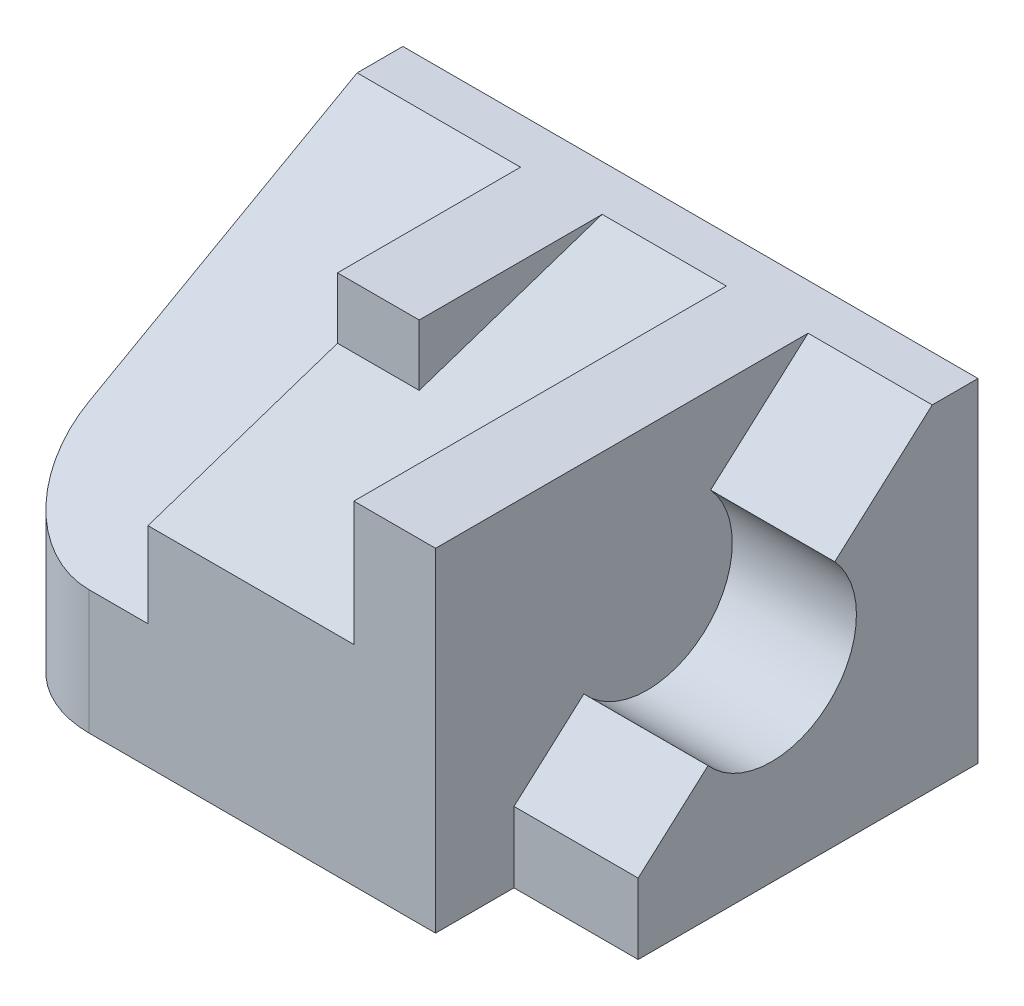
ISO-10303-21;
HEADER;
FILE_DESCRIPTION(('STEP AP214'),'2;1');
FILE_NAME('part.step','',(''),(''),'','','');
FILE_SCHEMA(('AUTOMOTIVE_DESIGN { 1 0 10303 214 1 1 1 1 }'));
ENDSEC;
DATA;
#1=APPLICATION_CONTEXT('core data for automotive mechanical design processes');
#2=APPLICATION_PROTOCOL_DEFINITION('international standard','automotive_design',2000,#1);
#3=PRODUCT_CONTEXT('',#1,'mechanical');
#4=PRODUCT('Part','Part','',(#3));
#5=PRODUCT_RELATED_PRODUCT_CATEGORY('part','',(#4));
#6=PRODUCT_DEFINITION_FORMATION('','',#4);
#7=PRODUCT_DEFINITION_CONTEXT('part definition',#1,'design');
#8=PRODUCT_DEFINITION('design','',#6,#7);
#9=PRODUCT_DEFINITION_SHAPE('','',#8);
#10=(LENGTH_UNIT() NAMED_UNIT(*) SI_UNIT(.MILLI.,.METRE.));
#11=(NAMED_UNIT(*) PLANE_ANGLE_UNIT() SI_UNIT($,.RADIAN.));
#12=(NAMED_UNIT(*) SI_UNIT($,.STERADIAN.) SOLID_ANGLE_UNIT());
#13=UNCERTAINTY_MEASURE_WITH_UNIT(LENGTH_MEASURE(1.E-05),#10,'distance_accuracy_value','');
#14=(GEOMETRIC_REPRESENTATION_CONTEXT(3) GLOBAL_UNCERTAINTY_ASSIGNED_CONTEXT((#13)) GLOBAL_UNIT_ASSIGNED_CONTEXT((#10,
#11,#12)) REPRESENTATION_CONTEXT('',''));
#15=CARTESIAN_POINT('',(0.,0.,0.));
#16=DIRECTION('',(0.,0.,1.));
#17=DIRECTION('',(1.,0.,0.));
#18=AXIS2_PLACEMENT_3D('',#15,#16,#17);
#19=CARTESIAN_POINT('',(44.,25.5,26.));
#20=DIRECTION('',(0.,0.,-1.));
#21=DIRECTION('',(-1.,0.,0.));
#22=AXIS2_PLACEMENT_3D('',#19,#20,#21);
#23=PLANE('',#22);
#24=DIRECTION('',(1.,0.,0.));
#25=VECTOR('',#24,1.);
#26=CARTESIAN_POINT('',(34.5,5.4,26.));
#27=LINE('',#26,#25);
#28=CARTESIAN_POINT('',(34.5,5.4,26.));
#29=VERTEX_POINT('',#28);
#30=CARTESIAN_POINT('',(44.,5.4,26.));
#31=VERTEX_POINT('',#30);
#32=EDGE_CURVE('E203',#29,#31,#27,.T.);
#33=ORIENTED_EDGE('',*,*,#32,.F.);
#34=DIRECTION('',(0.,-1.,0.));
#35=VECTOR('',#34,1.);
#36=CARTESIAN_POINT('',(34.5,25.5,26.));
#37=LINE('',#36,#35);
#38=CARTESIAN_POINT('',(34.5,0.,26.));
#39=VERTEX_POINT('',#38);
#40=EDGE_CURVE('E283',#29,#39,#37,.T.);
#41=ORIENTED_EDGE('',*,*,#40,.T.);
#42=DIRECTION('',(1.,0.,0.));
#43=VECTOR('',#42,1.);
#44=CARTESIAN_POINT('',(44.,0.,26.));
#45=LINE('',#44,#43);
#46=CARTESIAN_POINT('',(44.,0.,26.));
#47=VERTEX_POINT('',#46);
#48=EDGE_CURVE('E270',#39,#47,#45,.T.);
#49=ORIENTED_EDGE('',*,*,#48,.T.);
#50=DIRECTION('',(0.,-1.,0.));
#51=VECTOR('',#50,1.);
#52=CARTESIAN_POINT('',(44.,25.5,26.));
#53=LINE('',#52,#51);
#54=EDGE_CURVE('E281',#31,#47,#53,.T.);
#55=ORIENTED_EDGE('',*,*,#54,.F.);
#56=EDGE_LOOP('',(#33,#41,#49,#55));
#57=FACE_BOUND('',#56,.T.);
#58=ADVANCED_FACE('F57',(#57),#23,.F.);
#59=CARTESIAN_POINT('',(44.,25.5,0.));
#60=DIRECTION('',(-1.,0.,0.));
#61=DIRECTION('',(0.,0.,1.));
#62=AXIS2_PLACEMENT_3D('',#59,#60,#61);
#63=PLANE('',#62);
#64=DIRECTION('',(0.,-0.666213345314534,0.745761207441643));
#65=VECTOR('',#64,1.);
#66=CARTESIAN_POINT('',(44.,15.9210005932371,14.2227605299585));
#67=LINE('',#66,#65);
#68=CARTESIAN_POINT('',(44.,10.1762912770331,20.6534052869032));
#69=VERTEX_POINT('',#68);
#70=EDGE_CURVE('E195',#69,#31,#67,.T.);
#71=ORIENTED_EDGE('',*,*,#70,.T.);
#72=ORIENTED_EDGE('',*,*,#54,.T.);
#73=DIRECTION('',(0.,0.,-1.));
#74=VECTOR('',#73,1.);
#75=CARTESIAN_POINT('',(44.,0.,0.));
#76=LINE('',#75,#74);
#77=CARTESIAN_POINT('',(44.,0.,0.));
#78=VERTEX_POINT('',#77);
#79=EDGE_CURVE('E273',#47,#78,#76,.T.);
#80=ORIENTED_EDGE('',*,*,#79,.T.);
#81=DIRECTION('',(0.,-1.,0.));
#82=VECTOR('',#81,1.);
#83=CARTESIAN_POINT('',(44.,25.5,0.));
#84=LINE('',#83,#82);
#85=CARTESIAN_POINT('',(44.,25.5,0.));
#86=VERTEX_POINT('',#85);
#87=EDGE_CURVE('E278',#86,#78,#84,.T.);
#88=ORIENTED_EDGE('',*,*,#87,.F.);
#89=DIRECTION('',(0.,0.,-1.));
#90=VECTOR('',#89,1.);
#91=CARTESIAN_POINT('',(44.,25.5,0.));
#92=LINE('',#91,#90);
#93=CARTESIAN_POINT('',(44.,25.5,3.5));
#94=VERTEX_POINT('',#93);
#95=EDGE_CURVE('E260',#94,#86,#92,.T.);
#96=ORIENTED_EDGE('',*,*,#95,.F.);
#97=CARTESIAN_POINT('',(44.,18.8370565576515,10.9585187787484));
#98=VERTEX_POINT('',#97);
#99=EDGE_CURVE('E191',#94,#98,#67,.T.);
#100=ORIENTED_EDGE('',*,*,#99,.T.);
#101=CARTESIAN_POINT('',(44.,14.5,15.8));
#102=DIRECTION('',(1.,0.,0.));
#103=DIRECTION('',(0.,0.,-1.));
#104=AXIS2_PLACEMENT_3D('',#101,#102,#103);
#105=CIRCLE('',#104,6.5);
#106=EDGE_CURVE('E176',#69,#98,#105,.T.);
#107=ORIENTED_EDGE('',*,*,#106,.F.);
#108=EDGE_LOOP('',(#71,#72,#80,#88,#96,#100,#107));
#109=FACE_BOUND('',#108,.T.);
#110=ADVANCED_FACE('F337',(#109),#63,.F.);
#111=CARTESIAN_POINT('',(0.,25.5,0.));
#112=DIRECTION('',(0.,-1.,0.));
#113=DIRECTION('',(0.,0.,-1.));
#114=AXIS2_PLACEMENT_3D('',#111,#112,#113);
#115=PLANE('',#114);
#116=DIRECTION('',(1.,0.,0.));
#117=VECTOR('',#116,1.);
#118=CARTESIAN_POINT('',(34.5,25.5,3.5));
#119=LINE('',#118,#117);
#120=CARTESIAN_POINT('',(34.5,25.5,3.5));
#121=VERTEX_POINT('',#120);
#122=EDGE_CURVE('E180',#121,#94,#119,.T.);
#123=ORIENTED_EDGE('',*,*,#122,.T.);
#124=ORIENTED_EDGE('',*,*,#95,.T.);
#125=DIRECTION('',(-1.,0.,0.));
#126=VECTOR('',#125,1.);
#127=CARTESIAN_POINT('',(0.,25.5,0.));
#128=LINE('',#127,#126);
#129=CARTESIAN_POINT('',(0.,25.5,0.));
#130=VERTEX_POINT('',#129);
#131=EDGE_CURVE('E262',#86,#130,#128,.T.);
#132=ORIENTED_EDGE('',*,*,#131,.T.);
#133=DIRECTION('',(0.,0.,1.));
#134=VECTOR('',#133,1.);
#135=CARTESIAN_POINT('',(0.,25.5,32.));
#136=LINE('',#135,#134);
#137=CARTESIAN_POINT('',(0.,25.5,3.5));
#138=VERTEX_POINT('',#137);
#139=EDGE_CURVE('E252',#130,#138,#136,.T.);
#140=ORIENTED_EDGE('',*,*,#139,.T.);
#141=DIRECTION('',(-1.,0.,0.));
#142=VECTOR('',#141,1.);
#143=CARTESIAN_POINT('',(12.5,25.5,3.5));
#144=LINE('',#143,#142);
#145=CARTESIAN_POINT('',(12.5,25.5,3.5));
#146=VERTEX_POINT('',#145);
#147=EDGE_CURVE('E245',#146,#138,#144,.T.);
#148=ORIENTED_EDGE('',*,*,#147,.F.);
#149=DIRECTION('',(0.,0.,-1.));
#150=VECTOR('',#149,1.);
#151=CARTESIAN_POINT('',(12.5,25.5,0.));
#152=LINE('',#151,#150);
#153=CARTESIAN_POINT('',(12.5,25.5,17.5));
#154=VERTEX_POINT('',#153);
#155=EDGE_CURVE('E215',#154,#146,#152,.T.);
#156=ORIENTED_EDGE('',*,*,#155,.F.);
#157=DIRECTION('',(-1.,0.,0.));
#158=VECTOR('',#157,1.);
#159=CARTESIAN_POINT('',(0.,25.5,17.5));
#160=LINE('',#159,#158);
#161=CARTESIAN_POINT('',(18.75,25.5,17.5));
#162=VERTEX_POINT('',#161);
#163=EDGE_CURVE('E211',#162,#154,#160,.T.);
#164=ORIENTED_EDGE('',*,*,#163,.F.);
#165=DIRECTION('',(0.,0.,1.));
#166=VECTOR('',#165,1.);
#167=CARTESIAN_POINT('',(18.75,25.5,0.));
#168=LINE('',#167,#166);
#169=CARTESIAN_POINT('',(18.75,25.5,3.50000000000002));
#170=VERTEX_POINT('',#169);
#171=EDGE_CURVE('E207',#170,#162,#168,.T.);
#172=ORIENTED_EDGE('',*,*,#171,.F.);
#173=DIRECTION('',(-1.,0.,0.));
#174=VECTOR('',#173,1.);
#175=CARTESIAN_POINT('',(28.25,25.5,3.5));
#176=LINE('',#175,#174);
#177=CARTESIAN_POINT('',(28.25,25.5,3.5));
#178=VERTEX_POINT('',#177);
#179=EDGE_CURVE('E232',#178,#170,#176,.T.);
#180=ORIENTED_EDGE('',*,*,#179,.F.);
#181=DIRECTION('',(0.,0.,-1.));
#182=VECTOR('',#181,1.);
#183=CARTESIAN_POINT('',(28.25,25.5,0.));
#184=LINE('',#183,#182);
#185=CARTESIAN_POINT('',(28.25,25.5,32.));
#186=VERTEX_POINT('',#185);
#187=EDGE_CURVE('E224',#186,#178,#184,.T.);
#188=ORIENTED_EDGE('',*,*,#187,.F.);
#189=DIRECTION('',(1.,0.,0.));
#190=VECTOR('',#189,1.);
#191=CARTESIAN_POINT('',(34.5,25.5,32.));
#192=LINE('',#191,#190);
#193=CARTESIAN_POINT('',(34.5,25.5,32.));
#194=VERTEX_POINT('',#193);
#195=EDGE_CURVE('E255',#186,#194,#192,.T.);
#196=ORIENTED_EDGE('',*,*,#195,.T.);
#197=DIRECTION('',(0.,0.,-1.));
#198=VECTOR('',#197,1.);
#199=CARTESIAN_POINT('',(34.5,25.5,26.));
#200=LINE('',#199,#198);
#201=EDGE_CURVE('E258',#194,#121,#200,.T.);
#202=ORIENTED_EDGE('',*,*,#201,.T.);
#203=EDGE_LOOP('',(#123,#124,#132,#140,#148,#156,#164,#172,#180,#188,#196,#202));
#204=FACE_BOUND('',#203,.T.);
#205=ADVANCED_FACE('F306',(#204),#115,.F.);
#206=CARTESIAN_POINT('',(28.25,24.,8.));
#207=DIRECTION('',(0.,-0.948683298050514,-0.316227766016838));
#208=DIRECTION('',(0.,0.316227766016838,-0.948683298050514));
#209=AXIS2_PLACEMENT_3D('',#206,#207,#208);
#210=PLANE('',#209);
#211=DIRECTION('',(-1.,0.,0.));
#212=VECTOR('',#211,1.);
#213=CARTESIAN_POINT('',(0.,20.8333333333333,17.5));
#214=LINE('',#213,#212);
#215=CARTESIAN_POINT('',(18.75,20.8333333333333,17.5));
#216=VERTEX_POINT('',#215);
#217=CARTESIAN_POINT('',(12.5,20.8333333333333,17.5));
#218=VERTEX_POINT('',#217);
#219=EDGE_CURVE('E219',#216,#218,#214,.T.);
#220=ORIENTED_EDGE('',*,*,#219,.T.);
#221=DIRECTION('',(0.,-0.316227766016838,0.948683298050514));
#222=VECTOR('',#221,1.);
#223=CARTESIAN_POINT('',(12.5,24.,8.));
#224=LINE('',#223,#222);
#225=CARTESIAN_POINT('',(12.5,16.,32.));
#226=VERTEX_POINT('',#225);
#227=EDGE_CURVE('E210',#218,#226,#224,.T.);
#228=ORIENTED_EDGE('',*,*,#227,.T.);
#229=DIRECTION('',(-1.,0.,0.));
#230=VECTOR('',#229,1.);
#231=CARTESIAN_POINT('',(28.25,16.,32.));
#232=LINE('',#231,#230);
#233=CARTESIAN_POINT('',(28.25,16.,32.));
#234=VERTEX_POINT('',#233);
#235=EDGE_CURVE('E234',#234,#226,#232,.T.);
#236=ORIENTED_EDGE('',*,*,#235,.F.);
#237=DIRECTION('',(0.,-0.316227766016838,0.948683298050514));
#238=VECTOR('',#237,1.);
#239=CARTESIAN_POINT('',(28.25,24.,8.));
#240=LINE('',#239,#238);
#241=EDGE_CURVE('E227',#178,#234,#240,.T.);
#242=ORIENTED_EDGE('',*,*,#241,.F.);
#243=ORIENTED_EDGE('',*,*,#179,.T.);
#244=DIRECTION('',(0.,-0.316227766016838,0.948683298050514));
#245=VECTOR('',#244,1.);
#246=CARTESIAN_POINT('',(18.75,24.7420251858704,5.77392444238897));
#247=LINE('',#246,#245);
#248=EDGE_CURVE('E202',#170,#216,#247,.T.);
#249=ORIENTED_EDGE('',*,*,#248,.T.);
#250=EDGE_LOOP('',(#220,#228,#236,#242,#243,#249));
#251=FACE_BOUND('',#250,.T.);
#252=ADVANCED_FACE('F312',(#251),#210,.F.);
#253=CARTESIAN_POINT('',(0.,25.5,32.));
#254=DIRECTION('',(1.,0.,0.));
#255=DIRECTION('',(0.,0.,-1.));
#256=AXIS2_PLACEMENT_3D('',#253,#254,#255);
#257=PLANE('',#256);
#258=DIRECTION('',(0.,0.,1.));
#259=VECTOR('',#258,1.);
#260=CARTESIAN_POINT('',(0.,0.,32.));
#261=LINE('',#260,#259);
#262=CARTESIAN_POINT('',(0.,0.,0.));
#263=VERTEX_POINT('',#262);
#264=CARTESIAN_POINT('',(0.,0.,24.));
#265=VERTEX_POINT('',#264);
#266=EDGE_CURVE('E250',#263,#265,#261,.T.);
#267=ORIENTED_EDGE('',*,*,#266,.T.);
#268=DIRECTION('',(0.,-1.,0.));
#269=VECTOR('',#268,1.);
#270=CARTESIAN_POINT('',(0.,25.5,24.));
#271=LINE('',#270,#269);
#272=CARTESIAN_POINT('',(0.,13.9912280701754,24.));
#273=VERTEX_POINT('',#272);
#274=EDGE_CURVE('E65',#265,#273,#271,.F.);
#275=ORIENTED_EDGE('',*,*,#274,.T.);
#276=DIRECTION('',(0.,-0.489534756707639,0.871983785385481));
#277=VECTOR('',#276,1.);
#278=CARTESIAN_POINT('',(0.,20.8831032061783,11.7238474139949));
#279=LINE('',#278,#277);
#280=EDGE_CURVE('E237',#138,#273,#279,.T.);
#281=ORIENTED_EDGE('',*,*,#280,.F.);
#282=ORIENTED_EDGE('',*,*,#139,.F.);
#283=DIRECTION('',(0.,-1.,0.));
#284=VECTOR('',#283,1.);
#285=CARTESIAN_POINT('',(0.,25.5,0.));
#286=LINE('',#285,#284);
#287=EDGE_CURVE('E264',#130,#263,#286,.T.);
#288=ORIENTED_EDGE('',*,*,#287,.T.);
#289=EDGE_LOOP('',(#267,#275,#281,#282,#288));
#290=FACE_BOUND('',#289,.T.);
#291=ADVANCED_FACE('F325',(#290),#257,.F.);
#292=CARTESIAN_POINT('',(34.5,25.5,32.));
#293=DIRECTION('',(0.,0.,-1.));
#294=DIRECTION('',(-1.,0.,0.));
#295=AXIS2_PLACEMENT_3D('',#292,#293,#294);
#296=PLANE('',#295);
#297=DIRECTION('',(-1.,0.,0.));
#298=VECTOR('',#297,1.);
#299=CARTESIAN_POINT('',(12.5,9.5,32.));
#300=LINE('',#299,#298);
#301=CARTESIAN_POINT('',(12.5,9.5,32.));
#302=VERTEX_POINT('',#301);
#303=CARTESIAN_POINT('',(8.,9.5,32.));
#304=VERTEX_POINT('',#303);
#305=EDGE_CURVE('E247',#302,#304,#300,.T.);
#306=ORIENTED_EDGE('',*,*,#305,.T.);
#307=DIRECTION('',(0.,-1.,0.));
#308=VECTOR('',#307,1.);
#309=CARTESIAN_POINT('',(8.,25.5,32.));
#310=LINE('',#309,#308);
#311=CARTESIAN_POINT('',(8.,0.,32.));
#312=VERTEX_POINT('',#311);
#313=EDGE_CURVE('E288',#304,#312,#310,.T.);
#314=ORIENTED_EDGE('',*,*,#313,.T.);
#315=DIRECTION('',(1.,0.,0.));
#316=VECTOR('',#315,1.);
#317=CARTESIAN_POINT('',(34.5,0.,32.));
#318=LINE('',#317,#316);
#319=CARTESIAN_POINT('',(34.5,0.,32.));
#320=VERTEX_POINT('',#319);
#321=EDGE_CURVE('E266',#312,#320,#318,.T.);
#322=ORIENTED_EDGE('',*,*,#321,.T.);
#323=DIRECTION('',(0.,-1.,0.));
#324=VECTOR('',#323,1.);
#325=CARTESIAN_POINT('',(34.5,25.5,32.));
#326=LINE('',#325,#324);
#327=EDGE_CURVE('E285',#194,#320,#326,.T.);
#328=ORIENTED_EDGE('',*,*,#327,.F.);
#329=ORIENTED_EDGE('',*,*,#195,.F.);
#330=DIRECTION('',(0.,1.,0.));
#331=VECTOR('',#330,1.);
#332=CARTESIAN_POINT('',(28.25,0.,32.));
#333=LINE('',#332,#331);
#334=EDGE_CURVE('E230',#234,#186,#333,.T.);
#335=ORIENTED_EDGE('',*,*,#334,.F.);
#336=ORIENTED_EDGE('',*,*,#235,.T.);
#337=DIRECTION('',(0.,1.,0.));
#338=VECTOR('',#337,1.);
#339=CARTESIAN_POINT('',(12.5,0.,32.));
#340=LINE('',#339,#338);
#341=EDGE_CURVE('E242',#302,#226,#340,.T.);
#342=ORIENTED_EDGE('',*,*,#341,.F.);
#343=EDGE_LOOP('',(#306,#314,#322,#328,#329,#335,#336,#342));
#344=FACE_BOUND('',#343,.T.);
#345=ADVANCED_FACE('F293',(#344),#296,.F.);
#346=CARTESIAN_POINT('',(34.5,25.5,26.));
#347=DIRECTION('',(-1.,0.,0.));
#348=DIRECTION('',(0.,0.,1.));
#349=AXIS2_PLACEMENT_3D('',#346,#347,#348);
#350=PLANE('',#349);
#351=DIRECTION('',(0.,0.,-1.));
#352=VECTOR('',#351,1.);
#353=CARTESIAN_POINT('',(34.5,0.,26.));
#354=LINE('',#353,#352);
#355=EDGE_CURVE('E268',#320,#39,#354,.T.);
#356=ORIENTED_EDGE('',*,*,#355,.T.);
#357=ORIENTED_EDGE('',*,*,#40,.F.);
#358=DIRECTION('',(0.,-0.666213345314534,0.745761207441643));
#359=VECTOR('',#358,1.);
#360=CARTESIAN_POINT('',(34.5,15.9210005932371,14.2227605299585));
#361=LINE('',#360,#359);
#362=CARTESIAN_POINT('',(34.5,10.1762912770331,20.6534052869032));
#363=VERTEX_POINT('',#362);
#364=EDGE_CURVE('E181',#363,#29,#361,.T.);
#365=ORIENTED_EDGE('',*,*,#364,.F.);
#366=CARTESIAN_POINT('',(34.5,14.5,15.8));
#367=DIRECTION('',(1.,0.,0.));
#368=DIRECTION('',(0.,0.,-1.));
#369=AXIS2_PLACEMENT_3D('',#366,#367,#368);
#370=CIRCLE('',#369,6.5);
#371=CARTESIAN_POINT('',(34.5,18.8370565576515,10.9585187787484));
#372=VERTEX_POINT('',#371);
#373=EDGE_CURVE('E173',#363,#372,#370,.T.);
#374=ORIENTED_EDGE('',*,*,#373,.T.);
#375=EDGE_CURVE('E188',#121,#372,#361,.T.);
#376=ORIENTED_EDGE('',*,*,#375,.F.);
#377=ORIENTED_EDGE('',*,*,#201,.F.);
#378=ORIENTED_EDGE('',*,*,#327,.T.);
#379=EDGE_LOOP('',(#356,#357,#365,#374,#376,#377,#378));
#380=FACE_BOUND('',#379,.T.);
#381=ADVANCED_FACE('F186',(#380),#350,.F.);
#382=CARTESIAN_POINT('',(0.,25.5,0.));
#383=DIRECTION('',(0.,0.,1.));
#384=DIRECTION('',(1.,0.,0.));
#385=AXIS2_PLACEMENT_3D('',#382,#383,#384);
#386=PLANE('',#385);
#387=DIRECTION('',(-1.,0.,0.));
#388=VECTOR('',#387,1.);
#389=CARTESIAN_POINT('',(0.,0.,0.));
#390=LINE('',#389,#388);
#391=EDGE_CURVE('E256',#78,#263,#390,.T.);
#392=ORIENTED_EDGE('',*,*,#391,.T.);
#393=ORIENTED_EDGE('',*,*,#287,.F.);
#394=ORIENTED_EDGE('',*,*,#131,.F.);
#395=ORIENTED_EDGE('',*,*,#87,.T.);
#396=EDGE_LOOP('',(#392,#393,#394,#395));
#397=FACE_BOUND('',#396,.T.);
#398=ADVANCED_FACE('F351',(#397),#386,.F.);
#399=CARTESIAN_POINT('',(0.,0.,0.));
#400=DIRECTION('',(0.,-1.,0.));
#401=DIRECTION('',(0.,0.,-1.));
#402=AXIS2_PLACEMENT_3D('',#399,#400,#401);
#403=PLANE('',#402);
#404=ORIENTED_EDGE('',*,*,#321,.F.);
#405=CARTESIAN_POINT('',(8.,0.,24.));
#406=DIRECTION('',(0.,-1.,0.));
#407=DIRECTION('',(0.,0.,-1.));
#408=AXIS2_PLACEMENT_3D('',#405,#406,#407);
#409=CIRCLE('',#408,8.);
#410=EDGE_CURVE('E79',#312,#265,#409,.T.);
#411=ORIENTED_EDGE('',*,*,#410,.T.);
#412=ORIENTED_EDGE('',*,*,#266,.F.);
#413=ORIENTED_EDGE('',*,*,#391,.F.);
#414=ORIENTED_EDGE('',*,*,#79,.F.);
#415=ORIENTED_EDGE('',*,*,#48,.F.);
#416=ORIENTED_EDGE('',*,*,#355,.F.);
#417=EDGE_LOOP('',(#404,#411,#412,#413,#414,#415,#416));
#418=FACE_BOUND('',#417,.T.);
#419=ADVANCED_FACE('F299',(#418),#403,.T.);
#420=CARTESIAN_POINT('',(12.5,20.8831032061783,11.7238474139949));
#421=DIRECTION('',(0.,-0.871983785385481,-0.489534756707639));
#422=DIRECTION('',(0.,0.489534756707639,-0.871983785385481));
#423=AXIS2_PLACEMENT_3D('',#420,#421,#422);
#424=PLANE('',#423);
#425=ORIENTED_EDGE('',*,*,#280,.T.);
#426=CARTESIAN_POINT('',(8.,13.9912280701754,24.));
#427=DIRECTION('',(0.,-0.871983785385481,-0.489534756707639));
#428=DIRECTION('',(0.,-0.489534756707639,0.871983785385481));
#429=AXIS2_PLACEMENT_3D('',#426,#427,#428);
#430=ELLIPSE('',#429,9.1744825237357,8.);
#431=EDGE_CURVE('E12',#273,#304,#430,.F.);
#432=ORIENTED_EDGE('',*,*,#431,.T.);
#433=ORIENTED_EDGE('',*,*,#305,.F.);
#434=DIRECTION('',(0.,-0.489534756707639,0.871983785385481));
#435=VECTOR('',#434,1.);
#436=CARTESIAN_POINT('',(12.5,20.8831032061783,11.7238474139949));
#437=LINE('',#436,#435);
#438=EDGE_CURVE('E239',#146,#302,#437,.T.);
#439=ORIENTED_EDGE('',*,*,#438,.F.);
#440=ORIENTED_EDGE('',*,*,#147,.T.);
#441=EDGE_LOOP('',(#425,#432,#433,#439,#440));
#442=FACE_BOUND('',#441,.T.);
#443=ADVANCED_FACE('F320',(#442),#424,.F.);
#444=CARTESIAN_POINT('',(12.5,0.,0.));
#445=DIRECTION('',(-1.,0.,0.));
#446=DIRECTION('',(0.,0.,1.));
#447=AXIS2_PLACEMENT_3D('',#444,#445,#446);
#448=PLANE('',#447);
#449=ORIENTED_EDGE('',*,*,#227,.F.);
#450=DIRECTION('',(0.,1.,0.));
#451=VECTOR('',#450,1.);
#452=CARTESIAN_POINT('',(12.5,7.42025185870343,17.5));
#453=LINE('',#452,#451);
#454=EDGE_CURVE('E218',#218,#154,#453,.T.);
#455=ORIENTED_EDGE('',*,*,#454,.T.);
#456=ORIENTED_EDGE('',*,*,#155,.T.);
#457=ORIENTED_EDGE('',*,*,#438,.T.);
#458=ORIENTED_EDGE('',*,*,#341,.T.);
#459=EDGE_LOOP('',(#449,#455,#456,#457,#458));
#460=FACE_BOUND('',#459,.T.);
#461=ADVANCED_FACE('F315',(#460),#448,.T.);
#462=CARTESIAN_POINT('',(28.25,0.,0.));
#463=DIRECTION('',(-1.,0.,0.));
#464=DIRECTION('',(0.,0.,1.));
#465=AXIS2_PLACEMENT_3D('',#462,#463,#464);
#466=PLANE('',#465);
#467=ORIENTED_EDGE('',*,*,#187,.T.);
#468=ORIENTED_EDGE('',*,*,#241,.T.);
#469=ORIENTED_EDGE('',*,*,#334,.T.);
#470=EDGE_LOOP('',(#467,#468,#469));
#471=FACE_BOUND('',#470,.T.);
#472=ADVANCED_FACE('F310',(#471),#466,.T.);
#473=CARTESIAN_POINT('',(0.,7.42025185870343,17.5));
#474=DIRECTION('',(0.,0.,-1.));
#475=DIRECTION('',(-1.,0.,0.));
#476=AXIS2_PLACEMENT_3D('',#473,#474,#475);
#477=PLANE('',#476);
#478=ORIENTED_EDGE('',*,*,#219,.F.);
#479=DIRECTION('',(0.,1.,0.));
#480=VECTOR('',#479,1.);
#481=CARTESIAN_POINT('',(18.75,7.42025185870343,17.5));
#482=LINE('',#481,#480);
#483=EDGE_CURVE('E214',#216,#162,#482,.T.);
#484=ORIENTED_EDGE('',*,*,#483,.T.);
#485=ORIENTED_EDGE('',*,*,#163,.T.);
#486=ORIENTED_EDGE('',*,*,#454,.F.);
#487=EDGE_LOOP('',(#478,#484,#485,#486));
#488=FACE_BOUND('',#487,.T.);
#489=ADVANCED_FACE('F383',(#488),#477,.F.);
#490=CARTESIAN_POINT('',(18.75,7.42025185870343,0.));
#491=DIRECTION('',(-1.,0.,0.));
#492=DIRECTION('',(0.,0.,1.));
#493=AXIS2_PLACEMENT_3D('',#490,#491,#492);
#494=PLANE('',#493);
#495=ORIENTED_EDGE('',*,*,#248,.F.);
#496=ORIENTED_EDGE('',*,*,#171,.T.);
#497=ORIENTED_EDGE('',*,*,#483,.F.);
#498=EDGE_LOOP('',(#495,#496,#497));
#499=FACE_BOUND('',#498,.T.);
#500=ADVANCED_FACE('F333',(#499),#494,.F.);
#501=CARTESIAN_POINT('',(34.5,15.9210005932371,14.2227605299585));
#502=DIRECTION('',(0.,0.745761207441643,0.666213345314534));
#503=DIRECTION('',(0.,-0.666213345314534,0.745761207441643));
#504=AXIS2_PLACEMENT_3D('',#501,#502,#503);
#505=PLANE('',#504);
#506=ORIENTED_EDGE('',*,*,#70,.F.);
#507=DIRECTION('',(1.,0.,0.));
#508=VECTOR('',#507,1.);
#509=CARTESIAN_POINT('',(34.5,10.1762912770331,20.6534052869032));
#510=LINE('',#509,#508);
#511=EDGE_CURVE('E200',#363,#69,#510,.T.);
#512=ORIENTED_EDGE('',*,*,#511,.F.);
#513=ORIENTED_EDGE('',*,*,#364,.T.);
#514=ORIENTED_EDGE('',*,*,#32,.T.);
#515=EDGE_LOOP('',(#506,#512,#513,#514));
#516=FACE_BOUND('',#515,.T.);
#517=ADVANCED_FACE('F332',(#516),#505,.T.);
#518=ORIENTED_EDGE('',*,*,#99,.F.);
#519=ORIENTED_EDGE('',*,*,#122,.F.);
#520=ORIENTED_EDGE('',*,*,#375,.T.);
#521=DIRECTION('',(1.,0.,0.));
#522=VECTOR('',#521,1.);
#523=CARTESIAN_POINT('',(34.5,18.8370565576515,10.9585187787484));
#524=LINE('',#523,#522);
#525=EDGE_CURVE('E170',#372,#98,#524,.T.);
#526=ORIENTED_EDGE('',*,*,#525,.T.);
#527=EDGE_LOOP('',(#518,#519,#520,#526));
#528=FACE_BOUND('',#527,.T.);
#529=ADVANCED_FACE('F193',(#528),#505,.T.);
#530=CARTESIAN_POINT('',(34.5,14.5,15.8));
#531=DIRECTION('',(1.,0.,0.));
#532=DIRECTION('',(0.,0.,-1.));
#533=AXIS2_PLACEMENT_3D('',#530,#531,#532);
#534=CYLINDRICAL_SURFACE('',#533,6.5);
#535=ORIENTED_EDGE('',*,*,#511,.T.);
#536=ORIENTED_EDGE('',*,*,#106,.T.);
#537=ORIENTED_EDGE('',*,*,#525,.F.);
#538=ORIENTED_EDGE('',*,*,#373,.F.);
#539=EDGE_LOOP('',(#535,#536,#537,#538));
#540=FACE_BOUND('',#539,.T.);
#541=ADVANCED_FACE('F172',(#540),#534,.F.);
#542=CARTESIAN_POINT('',(8.,25.5,24.));
#543=DIRECTION('',(0.,-1.,0.));
#544=DIRECTION('',(0.,0.,-1.));
#545=AXIS2_PLACEMENT_3D('',#542,#543,#544);
#546=CYLINDRICAL_SURFACE('',#545,8.);
#547=ORIENTED_EDGE('',*,*,#431,.F.);
#548=ORIENTED_EDGE('',*,*,#274,.F.);
#549=ORIENTED_EDGE('',*,*,#410,.F.);
#550=ORIENTED_EDGE('',*,*,#313,.F.);
#551=EDGE_LOOP('',(#547,#548,#549,#550));
#552=FACE_BOUND('',#551,.T.);
#553=ADVANCED_FACE('F59',(#552),#546,.T.);
#554=CLOSED_SHELL('',(#58,#110,#205,#252,#291,#345,#381,#398,#419,#443,#461,#472,#489,#500,#517,
#529,#541,#553));
#555=MANIFOLD_SOLID_BREP('B2',#554);
#556=ADVANCED_BREP_SHAPE_REPRESENTATION('',(#18,#555),#14);
#557=SHAPE_DEFINITION_REPRESENTATION(#9,#556);
ENDSEC;
END-ISO-10303-21;
